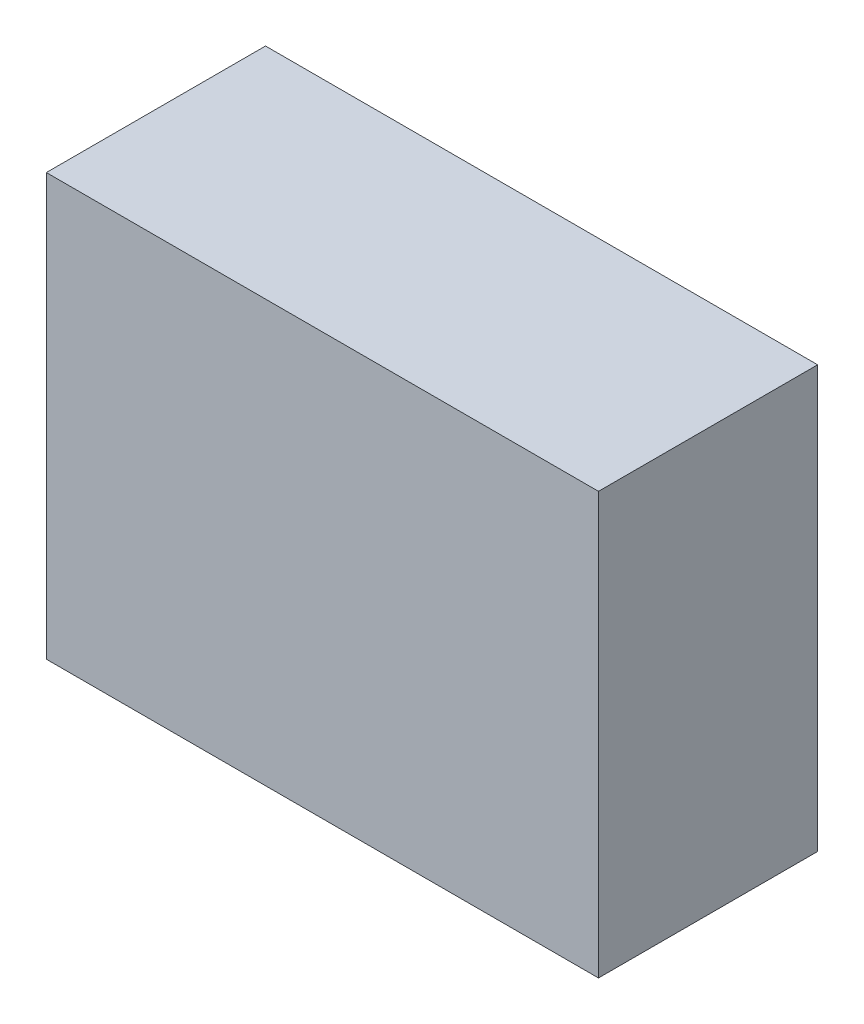
ISO-10303-21;
HEADER;
FILE_DESCRIPTION(('STEP AP214'),'2;1');
FILE_NAME('part.step','',(''),(''),'','','');
FILE_SCHEMA(('AUTOMOTIVE_DESIGN { 1 0 10303 214 1 1 1 1 }'));
ENDSEC;
DATA;
#1=APPLICATION_CONTEXT('core data for automotive mechanical design processes');
#2=APPLICATION_PROTOCOL_DEFINITION('international standard','automotive_design',2000,#1);
#3=PRODUCT_CONTEXT('',#1,'mechanical');
#4=PRODUCT('Part','Part','',(#3));
#5=PRODUCT_RELATED_PRODUCT_CATEGORY('part','',(#4));
#6=PRODUCT_DEFINITION_FORMATION('','',#4);
#7=PRODUCT_DEFINITION_CONTEXT('part definition',#1,'design');
#8=PRODUCT_DEFINITION('design','',#6,#7);
#9=PRODUCT_DEFINITION_SHAPE('','',#8);
#10=(LENGTH_UNIT() NAMED_UNIT(*) SI_UNIT(.MILLI.,.METRE.));
#11=(NAMED_UNIT(*) PLANE_ANGLE_UNIT() SI_UNIT($,.RADIAN.));
#12=(NAMED_UNIT(*) SI_UNIT($,.STERADIAN.) SOLID_ANGLE_UNIT());
#13=UNCERTAINTY_MEASURE_WITH_UNIT(LENGTH_MEASURE(1.E-05),#10,'distance_accuracy_value','');
#14=(GEOMETRIC_REPRESENTATION_CONTEXT(3) GLOBAL_UNCERTAINTY_ASSIGNED_CONTEXT((#13)) GLOBAL_UNIT_ASSIGNED_CONTEXT((#10,
#11,#12)) REPRESENTATION_CONTEXT('',''));
#15=CARTESIAN_POINT('',(0.,0.,0.));
#16=DIRECTION('',(0.,0.,1.));
#17=DIRECTION('',(1.,0.,0.));
#18=AXIS2_PLACEMENT_3D('',#15,#16,#17);
#19=CARTESIAN_POINT('',(-65.5,50.,52.));
#20=DIRECTION('',(1.,0.,0.));
#21=DIRECTION('',(0.,1.,0.));
#22=AXIS2_PLACEMENT_3D('',#19,#20,#21);
#23=PLANE('',#22);
#24=DIRECTION('',(0.,-1.,0.));
#25=VECTOR('',#24,1.);
#26=CARTESIAN_POINT('',(-65.5,50.,0.));
#27=LINE('',#26,#25);
#28=CARTESIAN_POINT('',(-65.5,50.,0.));
#29=VERTEX_POINT('',#28);
#30=CARTESIAN_POINT('',(-65.5,-50.,0.));
#31=VERTEX_POINT('',#30);
#32=EDGE_CURVE('E95',#29,#31,#27,.T.);
#33=ORIENTED_EDGE('',*,*,#32,.T.);
#34=DIRECTION('',(0.,0.,-1.));
#35=VECTOR('',#34,1.);
#36=CARTESIAN_POINT('',(-65.5,-50.,52.));
#37=LINE('',#36,#35);
#38=CARTESIAN_POINT('',(-65.5,-50.,52.));
#39=VERTEX_POINT('',#38);
#40=EDGE_CURVE('E11',#39,#31,#37,.T.);
#41=ORIENTED_EDGE('',*,*,#40,.F.);
#42=DIRECTION('',(0.,-1.,0.));
#43=VECTOR('',#42,1.);
#44=CARTESIAN_POINT('',(-65.5,50.,52.));
#45=LINE('',#44,#43);
#46=CARTESIAN_POINT('',(-65.5,50.,52.));
#47=VERTEX_POINT('',#46);
#48=EDGE_CURVE('E83',#47,#39,#45,.T.);
#49=ORIENTED_EDGE('',*,*,#48,.F.);
#50=DIRECTION('',(0.,0.,-1.));
#51=VECTOR('',#50,1.);
#52=CARTESIAN_POINT('',(-65.5,50.,52.));
#53=LINE('',#52,#51);
#54=EDGE_CURVE('E91',#47,#29,#53,.T.);
#55=ORIENTED_EDGE('',*,*,#54,.T.);
#56=EDGE_LOOP('',(#33,#41,#49,#55));
#57=FACE_BOUND('',#56,.T.);
#58=ADVANCED_FACE('F32',(#57),#23,.F.);
#59=CARTESIAN_POINT('',(65.5,-50.,52.));
#60=DIRECTION('',(0.,1.,0.));
#61=DIRECTION('',(-1.,0.,0.));
#62=AXIS2_PLACEMENT_3D('',#59,#60,#61);
#63=PLANE('',#62);
#64=DIRECTION('',(1.,0.,0.));
#65=VECTOR('',#64,1.);
#66=CARTESIAN_POINT('',(65.5,-50.,0.));
#67=LINE('',#66,#65);
#68=CARTESIAN_POINT('',(65.5,-50.,0.));
#69=VERTEX_POINT('',#68);
#70=EDGE_CURVE('E87',#31,#69,#67,.T.);
#71=ORIENTED_EDGE('',*,*,#70,.T.);
#72=DIRECTION('',(0.,0.,-1.));
#73=VECTOR('',#72,1.);
#74=CARTESIAN_POINT('',(65.5,-50.,52.));
#75=LINE('',#74,#73);
#76=CARTESIAN_POINT('',(65.5,-50.,52.));
#77=VERTEX_POINT('',#76);
#78=EDGE_CURVE('E40',#77,#69,#75,.T.);
#79=ORIENTED_EDGE('',*,*,#78,.F.);
#80=DIRECTION('',(1.,0.,0.));
#81=VECTOR('',#80,1.);
#82=CARTESIAN_POINT('',(65.5,-50.,52.));
#83=LINE('',#82,#81);
#84=EDGE_CURVE('E78',#39,#77,#83,.T.);
#85=ORIENTED_EDGE('',*,*,#84,.F.);
#86=ORIENTED_EDGE('',*,*,#40,.T.);
#87=EDGE_LOOP('',(#71,#79,#85,#86));
#88=FACE_BOUND('',#87,.T.);
#89=ADVANCED_FACE('F86',(#88),#63,.F.);
#90=CARTESIAN_POINT('',(65.5,50.,52.));
#91=DIRECTION('',(-1.,0.,0.));
#92=DIRECTION('',(0.,-1.,0.));
#93=AXIS2_PLACEMENT_3D('',#90,#91,#92);
#94=PLANE('',#93);
#95=DIRECTION('',(0.,1.,0.));
#96=VECTOR('',#95,1.);
#97=CARTESIAN_POINT('',(65.5,50.,0.));
#98=LINE('',#97,#96);
#99=CARTESIAN_POINT('',(65.5,50.,0.));
#100=VERTEX_POINT('',#99);
#101=EDGE_CURVE('E65',#69,#100,#98,.T.);
#102=ORIENTED_EDGE('',*,*,#101,.T.);
#103=DIRECTION('',(0.,0.,-1.));
#104=VECTOR('',#103,1.);
#105=CARTESIAN_POINT('',(65.5,50.,52.));
#106=LINE('',#105,#104);
#107=CARTESIAN_POINT('',(65.5,50.,52.));
#108=VERTEX_POINT('',#107);
#109=EDGE_CURVE('E88',#108,#100,#106,.T.);
#110=ORIENTED_EDGE('',*,*,#109,.F.);
#111=DIRECTION('',(0.,1.,0.));
#112=VECTOR('',#111,1.);
#113=CARTESIAN_POINT('',(65.5,50.,52.));
#114=LINE('',#113,#112);
#115=EDGE_CURVE('E81',#77,#108,#114,.T.);
#116=ORIENTED_EDGE('',*,*,#115,.F.);
#117=ORIENTED_EDGE('',*,*,#78,.T.);
#118=EDGE_LOOP('',(#102,#110,#116,#117));
#119=FACE_BOUND('',#118,.T.);
#120=ADVANCED_FACE('F89',(#119),#94,.F.);
#121=CARTESIAN_POINT('',(65.5,50.,52.));
#122=DIRECTION('',(0.,-1.,0.));
#123=DIRECTION('',(1.,0.,0.));
#124=AXIS2_PLACEMENT_3D('',#121,#122,#123);
#125=PLANE('',#124);
#126=DIRECTION('',(-1.,0.,0.));
#127=VECTOR('',#126,1.);
#128=CARTESIAN_POINT('',(65.5,50.,0.));
#129=LINE('',#128,#127);
#130=EDGE_CURVE('E71',#100,#29,#129,.T.);
#131=ORIENTED_EDGE('',*,*,#130,.T.);
#132=ORIENTED_EDGE('',*,*,#54,.F.);
#133=DIRECTION('',(-1.,0.,0.));
#134=VECTOR('',#133,1.);
#135=CARTESIAN_POINT('',(65.5,50.,52.));
#136=LINE('',#135,#134);
#137=EDGE_CURVE('E48',#108,#47,#136,.T.);
#138=ORIENTED_EDGE('',*,*,#137,.F.);
#139=ORIENTED_EDGE('',*,*,#109,.T.);
#140=EDGE_LOOP('',(#131,#132,#138,#139));
#141=FACE_BOUND('',#140,.T.);
#142=ADVANCED_FACE('F102',(#141),#125,.F.);
#143=CARTESIAN_POINT('',(0.,0.,52.));
#144=DIRECTION('',(0.,0.,-1.));
#145=DIRECTION('',(-1.,0.,0.));
#146=AXIS2_PLACEMENT_3D('',#143,#144,#145);
#147=PLANE('',#146);
#148=ORIENTED_EDGE('',*,*,#48,.T.);
#149=ORIENTED_EDGE('',*,*,#84,.T.);
#150=ORIENTED_EDGE('',*,*,#115,.T.);
#151=ORIENTED_EDGE('',*,*,#137,.T.);
#152=EDGE_LOOP('',(#148,#149,#150,#151));
#153=FACE_BOUND('',#152,.T.);
#154=ADVANCED_FACE('F79',(#153),#147,.F.);
#155=CARTESIAN_POINT('',(0.,0.,0.));
#156=DIRECTION('',(0.,0.,-1.));
#157=DIRECTION('',(-1.,0.,0.));
#158=AXIS2_PLACEMENT_3D('',#155,#156,#157);
#159=PLANE('',#158);
#160=ORIENTED_EDGE('',*,*,#32,.F.);
#161=ORIENTED_EDGE('',*,*,#130,.F.);
#162=ORIENTED_EDGE('',*,*,#101,.F.);
#163=ORIENTED_EDGE('',*,*,#70,.F.);
#164=EDGE_LOOP('',(#160,#161,#162,#163));
#165=FACE_BOUND('',#164,.T.);
#166=ADVANCED_FACE('F105',(#165),#159,.T.);
#167=CLOSED_SHELL('',(#58,#89,#120,#142,#154,#166));
#168=MANIFOLD_SOLID_BREP('B2',#167);
#169=ADVANCED_BREP_SHAPE_REPRESENTATION('',(#18,#168),#14);
#170=SHAPE_DEFINITION_REPRESENTATION(#9,#169);
ENDSEC;
END-ISO-10303-21;
